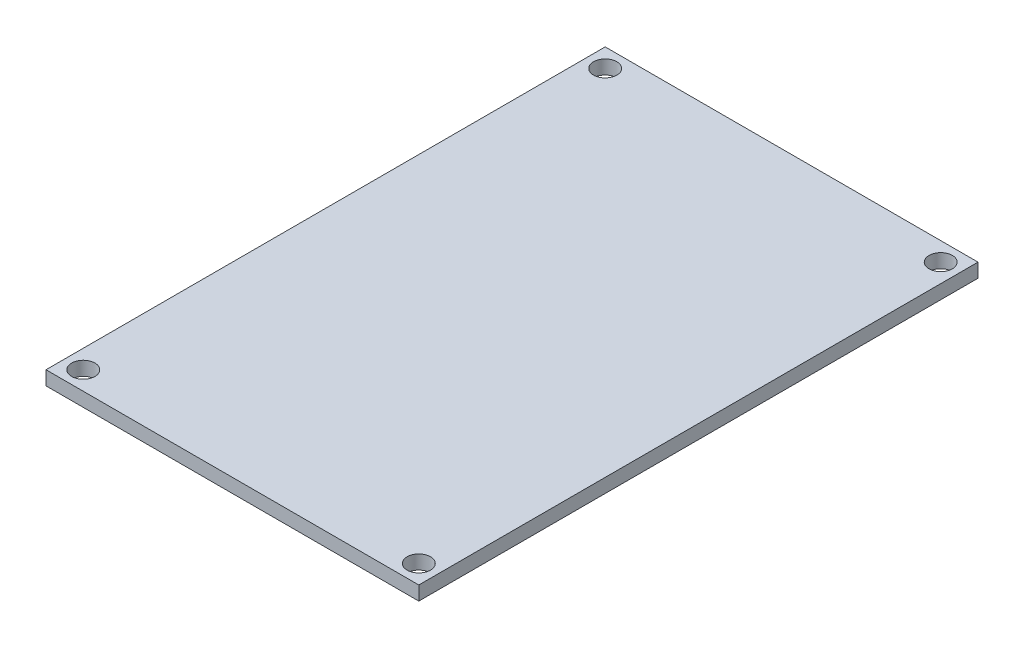
ISO-10303-21;
HEADER;
FILE_DESCRIPTION(('STEP AP214'),'2;1');
FILE_NAME('part.step','',(''),(''),'','','');
FILE_SCHEMA(('AUTOMOTIVE_DESIGN { 1 0 10303 214 1 1 1 1 }'));
ENDSEC;
DATA;
#1=APPLICATION_CONTEXT('core data for automotive mechanical design processes');
#2=APPLICATION_PROTOCOL_DEFINITION('international standard','automotive_design',2000,#1);
#3=PRODUCT_CONTEXT('',#1,'mechanical');
#4=PRODUCT('Part','Part','',(#3));
#5=PRODUCT_RELATED_PRODUCT_CATEGORY('part','',(#4));
#6=PRODUCT_DEFINITION_FORMATION('','',#4);
#7=PRODUCT_DEFINITION_CONTEXT('part definition',#1,'design');
#8=PRODUCT_DEFINITION('design','',#6,#7);
#9=PRODUCT_DEFINITION_SHAPE('','',#8);
#10=(LENGTH_UNIT() NAMED_UNIT(*) SI_UNIT(.MILLI.,.METRE.));
#11=(NAMED_UNIT(*) PLANE_ANGLE_UNIT() SI_UNIT($,.RADIAN.));
#12=(NAMED_UNIT(*) SI_UNIT($,.STERADIAN.) SOLID_ANGLE_UNIT());
#13=UNCERTAINTY_MEASURE_WITH_UNIT(LENGTH_MEASURE(1.E-05),#10,'distance_accuracy_value','');
#14=(GEOMETRIC_REPRESENTATION_CONTEXT(3) GLOBAL_UNCERTAINTY_ASSIGNED_CONTEXT((#13)) GLOBAL_UNIT_ASSIGNED_CONTEXT((#10,
#11,#12)) REPRESENTATION_CONTEXT('',''));
#15=CARTESIAN_POINT('',(0.,0.,0.));
#16=DIRECTION('',(0.,0.,1.));
#17=DIRECTION('',(1.,0.,0.));
#18=AXIS2_PLACEMENT_3D('',#15,#16,#17);
#19=CARTESIAN_POINT('',(8.55112540721894,17.3489488177002,87.2369749490172));
#20=DIRECTION('',(0.,0.,-1.));
#21=DIRECTION('',(-1.,0.,0.));
#22=AXIS2_PLACEMENT_3D('',#19,#20,#21);
#23=PLANE('',#22);
#24=DIRECTION('',(1.,0.,0.));
#25=VECTOR('',#24,1.);
#26=CARTESIAN_POINT('',(8.55112540721894,15.8489488177002,87.2369749490172));
#27=LINE('',#26,#25);
#28=CARTESIAN_POINT('',(-31.4488745927811,15.8489488177002,87.2369749490172));
#29=VERTEX_POINT('',#28);
#30=CARTESIAN_POINT('',(8.55112540721894,15.8489488177002,87.2369749490172));
#31=VERTEX_POINT('',#30);
#32=EDGE_CURVE('E79',#29,#31,#27,.T.);
#33=ORIENTED_EDGE('',*,*,#32,.T.);
#34=DIRECTION('',(0.,-1.,0.));
#35=VECTOR('',#34,1.);
#36=CARTESIAN_POINT('',(8.55112540721894,17.3489488177002,87.2369749490172));
#37=LINE('',#36,#35);
#38=CARTESIAN_POINT('',(8.55112540721894,17.3489488177002,87.2369749490172));
#39=VERTEX_POINT('',#38);
#40=EDGE_CURVE('E11',#39,#31,#37,.T.);
#41=ORIENTED_EDGE('',*,*,#40,.F.);
#42=DIRECTION('',(1.,0.,0.));
#43=VECTOR('',#42,1.);
#44=CARTESIAN_POINT('',(8.55112540721894,17.3489488177002,87.2369749490172));
#45=LINE('',#44,#43);
#46=CARTESIAN_POINT('',(-31.4488745927811,17.3489488177002,87.2369749490172));
#47=VERTEX_POINT('',#46);
#48=EDGE_CURVE('E67',#47,#39,#45,.T.);
#49=ORIENTED_EDGE('',*,*,#48,.F.);
#50=DIRECTION('',(0.,-1.,0.));
#51=VECTOR('',#50,1.);
#52=CARTESIAN_POINT('',(-31.4488745927811,17.3489488177002,87.2369749490172));
#53=LINE('',#52,#51);
#54=EDGE_CURVE('E75',#47,#29,#53,.T.);
#55=ORIENTED_EDGE('',*,*,#54,.T.);
#56=EDGE_LOOP('',(#33,#41,#49,#55));
#57=FACE_BOUND('',#56,.T.);
#58=ADVANCED_FACE('F16',(#57),#23,.F.);
#59=CARTESIAN_POINT('',(8.55112540721894,17.3489488177002,87.2369749490172));
#60=DIRECTION('',(-1.,0.,0.));
#61=DIRECTION('',(0.,0.,1.));
#62=AXIS2_PLACEMENT_3D('',#59,#60,#61);
#63=PLANE('',#62);
#64=DIRECTION('',(0.,0.,-1.));
#65=VECTOR('',#64,1.);
#66=CARTESIAN_POINT('',(8.55112540721894,15.8489488177002,87.2369749490172));
#67=LINE('',#66,#65);
#68=CARTESIAN_POINT('',(8.55112540721894,15.8489488177002,27.2369749490172));
#69=VERTEX_POINT('',#68);
#70=EDGE_CURVE('E71',#31,#69,#67,.T.);
#71=ORIENTED_EDGE('',*,*,#70,.T.);
#72=DIRECTION('',(0.,-1.,0.));
#73=VECTOR('',#72,1.);
#74=CARTESIAN_POINT('',(8.55112540721894,17.3489488177002,27.2369749490172));
#75=LINE('',#74,#73);
#76=CARTESIAN_POINT('',(8.55112540721894,17.3489488177002,27.2369749490172));
#77=VERTEX_POINT('',#76);
#78=EDGE_CURVE('E24',#77,#69,#75,.T.);
#79=ORIENTED_EDGE('',*,*,#78,.F.);
#80=DIRECTION('',(0.,0.,-1.));
#81=VECTOR('',#80,1.);
#82=CARTESIAN_POINT('',(8.55112540721894,17.3489488177002,87.2369749490172));
#83=LINE('',#82,#81);
#84=EDGE_CURVE('E62',#39,#77,#83,.T.);
#85=ORIENTED_EDGE('',*,*,#84,.F.);
#86=ORIENTED_EDGE('',*,*,#40,.T.);
#87=EDGE_LOOP('',(#71,#79,#85,#86));
#88=FACE_BOUND('',#87,.T.);
#89=ADVANCED_FACE('F70',(#88),#63,.F.);
#90=CARTESIAN_POINT('',(8.55112540721894,17.3489488177002,27.2369749490172));
#91=DIRECTION('',(0.,0.,1.));
#92=DIRECTION('',(1.,0.,0.));
#93=AXIS2_PLACEMENT_3D('',#90,#91,#92);
#94=PLANE('',#93);
#95=DIRECTION('',(-1.,0.,0.));
#96=VECTOR('',#95,1.);
#97=CARTESIAN_POINT('',(8.55112540721894,15.8489488177002,27.2369749490172));
#98=LINE('',#97,#96);
#99=CARTESIAN_POINT('',(-31.4488745927811,15.8489488177002,27.2369749490172));
#100=VERTEX_POINT('',#99);
#101=EDGE_CURVE('E49',#69,#100,#98,.T.);
#102=ORIENTED_EDGE('',*,*,#101,.T.);
#103=DIRECTION('',(0.,-1.,0.));
#104=VECTOR('',#103,1.);
#105=CARTESIAN_POINT('',(-31.4488745927811,17.3489488177002,27.2369749490172));
#106=LINE('',#105,#104);
#107=CARTESIAN_POINT('',(-31.4488745927811,17.3489488177002,27.2369749490172));
#108=VERTEX_POINT('',#107);
#109=EDGE_CURVE('E72',#108,#100,#106,.T.);
#110=ORIENTED_EDGE('',*,*,#109,.F.);
#111=DIRECTION('',(-1.,0.,0.));
#112=VECTOR('',#111,1.);
#113=CARTESIAN_POINT('',(8.55112540721894,17.3489488177002,27.2369749490172));
#114=LINE('',#113,#112);
#115=EDGE_CURVE('E65',#77,#108,#114,.T.);
#116=ORIENTED_EDGE('',*,*,#115,.F.);
#117=ORIENTED_EDGE('',*,*,#78,.T.);
#118=EDGE_LOOP('',(#102,#110,#116,#117));
#119=FACE_BOUND('',#118,.T.);
#120=ADVANCED_FACE('F73',(#119),#94,.F.);
#121=CARTESIAN_POINT('',(-31.4488745927811,17.3489488177002,87.2369749490172));
#122=DIRECTION('',(1.,0.,0.));
#123=DIRECTION('',(0.,0.,-1.));
#124=AXIS2_PLACEMENT_3D('',#121,#122,#123);
#125=PLANE('',#124);
#126=DIRECTION('',(0.,0.,1.));
#127=VECTOR('',#126,1.);
#128=CARTESIAN_POINT('',(-31.4488745927811,15.8489488177002,87.2369749490172));
#129=LINE('',#128,#127);
#130=EDGE_CURVE('E55',#100,#29,#129,.T.);
#131=ORIENTED_EDGE('',*,*,#130,.T.);
#132=ORIENTED_EDGE('',*,*,#54,.F.);
#133=DIRECTION('',(0.,0.,1.));
#134=VECTOR('',#133,1.);
#135=CARTESIAN_POINT('',(-31.4488745927811,17.3489488177002,87.2369749490172));
#136=LINE('',#135,#134);
#137=EDGE_CURVE('E32',#108,#47,#136,.T.);
#138=ORIENTED_EDGE('',*,*,#137,.F.);
#139=ORIENTED_EDGE('',*,*,#109,.T.);
#140=EDGE_LOOP('',(#131,#132,#138,#139));
#141=FACE_BOUND('',#140,.T.);
#142=ADVANCED_FACE('F87',(#141),#125,.F.);
#143=CARTESIAN_POINT('',(8.55112540721894,17.3489488177002,87.2369749490172));
#144=DIRECTION('',(0.,-1.,0.));
#145=DIRECTION('',(-1.,0.,0.));
#146=AXIS2_PLACEMENT_3D('',#143,#144,#145);
#147=PLANE('',#146);
#148=CARTESIAN_POINT('',(-29.4488745927811,17.3489488177002,29.2369749490172));
#149=DIRECTION('',(0.,1.,0.));
#150=DIRECTION('',(1.,0.,0.));
#151=AXIS2_PLACEMENT_3D('',#148,#149,#150);
#152=CIRCLE('',#151,1.25);
#153=CARTESIAN_POINT('',(-28.1988745927811,17.3489488177002,29.2369749490172));
#154=VERTEX_POINT('',#153);
#155=EDGE_CURVE('E99',#154,#154,#152,.T.);
#156=ORIENTED_EDGE('',*,*,#155,.F.);
#157=EDGE_LOOP('',(#156));
#158=FACE_BOUND('',#157,.T.);
#159=CARTESIAN_POINT('',(6.55112540721894,17.3489488177002,29.2369749490172));
#160=DIRECTION('',(0.,1.,0.));
#161=DIRECTION('',(1.,0.,0.));
#162=AXIS2_PLACEMENT_3D('',#159,#160,#161);
#163=CIRCLE('',#162,1.25);
#164=CARTESIAN_POINT('',(7.80112540721894,17.3489488177002,29.2369749490172));
#165=VERTEX_POINT('',#164);
#166=EDGE_CURVE('E105',#165,#165,#163,.T.);
#167=ORIENTED_EDGE('',*,*,#166,.F.);
#168=EDGE_LOOP('',(#167));
#169=FACE_BOUND('',#168,.T.);
#170=CARTESIAN_POINT('',(6.55112540721894,17.3489488177002,85.2369749490172));
#171=DIRECTION('',(0.,1.,0.));
#172=DIRECTION('',(1.,0.,0.));
#173=AXIS2_PLACEMENT_3D('',#170,#171,#172);
#174=CIRCLE('',#173,1.25);
#175=CARTESIAN_POINT('',(7.80112540721894,17.3489488177002,85.2369749490172));
#176=VERTEX_POINT('',#175);
#177=EDGE_CURVE('E111',#176,#176,#174,.T.);
#178=ORIENTED_EDGE('',*,*,#177,.F.);
#179=EDGE_LOOP('',(#178));
#180=FACE_BOUND('',#179,.T.);
#181=CARTESIAN_POINT('',(-29.4488745927811,17.3489488177002,85.2369749490172));
#182=DIRECTION('',(0.,1.,0.));
#183=DIRECTION('',(1.,0.,0.));
#184=AXIS2_PLACEMENT_3D('',#181,#182,#183);
#185=CIRCLE('',#184,1.25);
#186=CARTESIAN_POINT('',(-28.1988745927811,17.3489488177002,85.2369749490172));
#187=VERTEX_POINT('',#186);
#188=EDGE_CURVE('E93',#187,#187,#185,.T.);
#189=ORIENTED_EDGE('',*,*,#188,.F.);
#190=EDGE_LOOP('',(#189));
#191=FACE_BOUND('',#190,.T.);
#192=ORIENTED_EDGE('',*,*,#48,.T.);
#193=ORIENTED_EDGE('',*,*,#84,.T.);
#194=ORIENTED_EDGE('',*,*,#115,.T.);
#195=ORIENTED_EDGE('',*,*,#137,.T.);
#196=EDGE_LOOP('',(#192,#193,#194,#195));
#197=FACE_BOUND('',#196,.T.);
#198=ADVANCED_FACE('F63',(#158,#169,#180,#191,#197),#147,.F.);
#199=CARTESIAN_POINT('',(8.55112540721894,15.8489488177002,87.2369749490172));
#200=DIRECTION('',(0.,-1.,0.));
#201=DIRECTION('',(-1.,0.,0.));
#202=AXIS2_PLACEMENT_3D('',#199,#200,#201);
#203=PLANE('',#202);
#204=CARTESIAN_POINT('',(-29.4488745927811,15.8489488177002,29.2369749490172));
#205=DIRECTION('',(0.,1.,0.));
#206=DIRECTION('',(1.,0.,0.));
#207=AXIS2_PLACEMENT_3D('',#204,#205,#206);
#208=CIRCLE('',#207,1.25);
#209=CARTESIAN_POINT('',(-28.1988745927811,15.8489488177002,29.2369749490172));
#210=VERTEX_POINT('',#209);
#211=EDGE_CURVE('E102',#210,#210,#208,.T.);
#212=ORIENTED_EDGE('',*,*,#211,.T.);
#213=EDGE_LOOP('',(#212));
#214=FACE_BOUND('',#213,.T.);
#215=CARTESIAN_POINT('',(6.55112540721894,15.8489488177002,29.2369749490172));
#216=DIRECTION('',(0.,1.,0.));
#217=DIRECTION('',(1.,0.,0.));
#218=AXIS2_PLACEMENT_3D('',#215,#216,#217);
#219=CIRCLE('',#218,1.25);
#220=CARTESIAN_POINT('',(7.80112540721894,15.8489488177002,29.2369749490172));
#221=VERTEX_POINT('',#220);
#222=EDGE_CURVE('E108',#221,#221,#219,.T.);
#223=ORIENTED_EDGE('',*,*,#222,.T.);
#224=EDGE_LOOP('',(#223));
#225=FACE_BOUND('',#224,.T.);
#226=CARTESIAN_POINT('',(6.55112540721894,15.8489488177002,85.2369749490172));
#227=DIRECTION('',(0.,1.,0.));
#228=DIRECTION('',(1.,0.,0.));
#229=AXIS2_PLACEMENT_3D('',#226,#227,#228);
#230=CIRCLE('',#229,1.25);
#231=CARTESIAN_POINT('',(7.80112540721894,15.8489488177002,85.2369749490172));
#232=VERTEX_POINT('',#231);
#233=EDGE_CURVE('E96',#232,#232,#230,.T.);
#234=ORIENTED_EDGE('',*,*,#233,.T.);
#235=EDGE_LOOP('',(#234));
#236=FACE_BOUND('',#235,.T.);
#237=CARTESIAN_POINT('',(-29.4488745927811,15.8489488177002,85.2369749490172));
#238=DIRECTION('',(0.,1.,0.));
#239=DIRECTION('',(1.,0.,0.));
#240=AXIS2_PLACEMENT_3D('',#237,#238,#239);
#241=CIRCLE('',#240,1.25);
#242=CARTESIAN_POINT('',(-28.1988745927811,15.8489488177002,85.2369749490172));
#243=VERTEX_POINT('',#242);
#244=EDGE_CURVE('E82',#243,#243,#241,.T.);
#245=ORIENTED_EDGE('',*,*,#244,.T.);
#246=EDGE_LOOP('',(#245));
#247=FACE_BOUND('',#246,.T.);
#248=ORIENTED_EDGE('',*,*,#32,.F.);
#249=ORIENTED_EDGE('',*,*,#130,.F.);
#250=ORIENTED_EDGE('',*,*,#101,.F.);
#251=ORIENTED_EDGE('',*,*,#70,.F.);
#252=EDGE_LOOP('',(#248,#249,#250,#251));
#253=FACE_BOUND('',#252,.T.);
#254=ADVANCED_FACE('F90',(#214,#225,#236,#247,#253),#203,.T.);
#255=CARTESIAN_POINT('',(-29.4488745927811,15.8489488177002,85.2369749490172));
#256=DIRECTION('',(0.,1.,0.));
#257=DIRECTION('',(1.,0.,0.));
#258=AXIS2_PLACEMENT_3D('',#255,#256,#257);
#259=CYLINDRICAL_SURFACE('',#258,1.25);
#260=ORIENTED_EDGE('',*,*,#244,.F.);
#261=EDGE_LOOP('',(#260));
#262=FACE_BOUND('',#261,.T.);
#263=ORIENTED_EDGE('',*,*,#188,.T.);
#264=EDGE_LOOP('',(#263));
#265=FACE_BOUND('',#264,.T.);
#266=ADVANCED_FACE('F123',(#262,#265),#259,.F.);
#267=CARTESIAN_POINT('',(6.55112540721894,15.8489488177002,85.2369749490172));
#268=DIRECTION('',(0.,1.,0.));
#269=DIRECTION('',(1.,0.,0.));
#270=AXIS2_PLACEMENT_3D('',#267,#268,#269);
#271=CYLINDRICAL_SURFACE('',#270,1.25);
#272=ORIENTED_EDGE('',*,*,#233,.F.);
#273=EDGE_LOOP('',(#272));
#274=FACE_BOUND('',#273,.T.);
#275=ORIENTED_EDGE('',*,*,#177,.T.);
#276=EDGE_LOOP('',(#275));
#277=FACE_BOUND('',#276,.T.);
#278=ADVANCED_FACE('F119',(#274,#277),#271,.F.);
#279=CARTESIAN_POINT('',(6.55112540721894,15.8489488177002,29.2369749490172));
#280=DIRECTION('',(0.,1.,0.));
#281=DIRECTION('',(1.,0.,0.));
#282=AXIS2_PLACEMENT_3D('',#279,#280,#281);
#283=CYLINDRICAL_SURFACE('',#282,1.25);
#284=ORIENTED_EDGE('',*,*,#222,.F.);
#285=EDGE_LOOP('',(#284));
#286=FACE_BOUND('',#285,.T.);
#287=ORIENTED_EDGE('',*,*,#166,.T.);
#288=EDGE_LOOP('',(#287));
#289=FACE_BOUND('',#288,.T.);
#290=ADVANCED_FACE('F122',(#286,#289),#283,.F.);
#291=CARTESIAN_POINT('',(-29.4488745927811,15.8489488177002,29.2369749490172));
#292=DIRECTION('',(0.,1.,0.));
#293=DIRECTION('',(1.,0.,0.));
#294=AXIS2_PLACEMENT_3D('',#291,#292,#293);
#295=CYLINDRICAL_SURFACE('',#294,1.25);
#296=ORIENTED_EDGE('',*,*,#211,.F.);
#297=EDGE_LOOP('',(#296));
#298=FACE_BOUND('',#297,.T.);
#299=ORIENTED_EDGE('',*,*,#155,.T.);
#300=EDGE_LOOP('',(#299));
#301=FACE_BOUND('',#300,.T.);
#302=ADVANCED_FACE('F190',(#298,#301),#295,.F.);
#303=CLOSED_SHELL('',(#58,#89,#120,#142,#198,#254,#266,#278,#290,#302));
#304=MANIFOLD_SOLID_BREP('B1',#303);
#305=ADVANCED_BREP_SHAPE_REPRESENTATION('',(#18,#304),#14);
#306=SHAPE_DEFINITION_REPRESENTATION(#9,#305);
ENDSEC;
END-ISO-10303-21;
